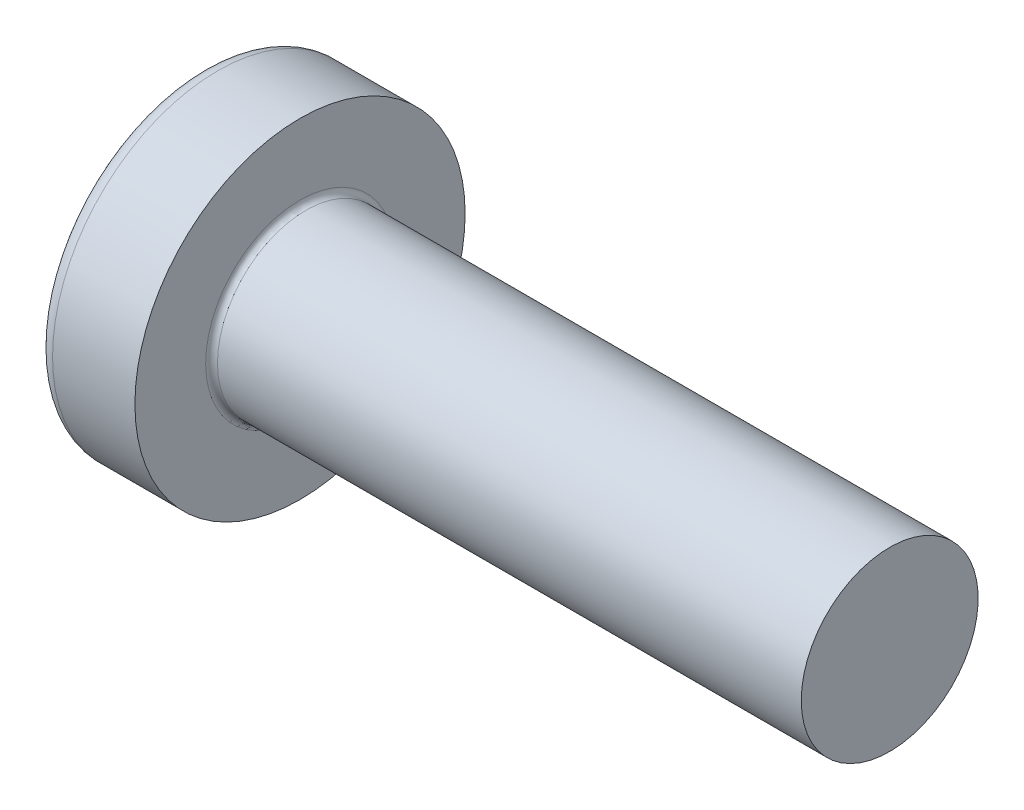
ISO-10303-21;
HEADER;
FILE_DESCRIPTION(('STEP AP214'),'2;1');
FILE_NAME('part.step','',(''),(''),'','','');
FILE_SCHEMA(('AUTOMOTIVE_DESIGN { 1 0 10303 214 1 1 1 1 }'));
ENDSEC;
DATA;
#1=APPLICATION_CONTEXT('core data for automotive mechanical design processes');
#2=APPLICATION_PROTOCOL_DEFINITION('international standard','automotive_design',2000,#1);
#3=PRODUCT_CONTEXT('',#1,'mechanical');
#4=PRODUCT('Part','Part','',(#3));
#5=PRODUCT_RELATED_PRODUCT_CATEGORY('part','',(#4));
#6=PRODUCT_DEFINITION_FORMATION('','',#4);
#7=PRODUCT_DEFINITION_CONTEXT('part definition',#1,'design');
#8=PRODUCT_DEFINITION('design','',#6,#7);
#9=PRODUCT_DEFINITION_SHAPE('','',#8);
#10=(LENGTH_UNIT() NAMED_UNIT(*) SI_UNIT(.MILLI.,.METRE.));
#11=(NAMED_UNIT(*) PLANE_ANGLE_UNIT() SI_UNIT($,.RADIAN.));
#12=(NAMED_UNIT(*) SI_UNIT($,.STERADIAN.) SOLID_ANGLE_UNIT());
#13=UNCERTAINTY_MEASURE_WITH_UNIT(LENGTH_MEASURE(1.E-05),#10,'distance_accuracy_value','');
#14=(GEOMETRIC_REPRESENTATION_CONTEXT(3) GLOBAL_UNCERTAINTY_ASSIGNED_CONTEXT((#13)) GLOBAL_UNIT_ASSIGNED_CONTEXT((#10,
#11,#12)) REPRESENTATION_CONTEXT('',''));
#15=CARTESIAN_POINT('',(0.,0.,0.));
#16=DIRECTION('',(0.,0.,1.));
#17=DIRECTION('',(1.,0.,0.));
#18=AXIS2_PLACEMENT_3D('',#15,#16,#17);
#19=CARTESIAN_POINT('',(5.,0.,0.));
#20=DIRECTION('',(-1.,0.,0.));
#21=DIRECTION('',(0.,1.,0.));
#22=AXIS2_PLACEMENT_3D('',#19,#20,#21);
#23=SPHERICAL_SURFACE('',#22,5.);
#24=CARTESIAN_POINT('',(0.775371598933733,0.,0.));
#25=DIRECTION('',(-1.,0.,0.));
#26=DIRECTION('',(0.,0.,1.));
#27=AXIS2_PLACEMENT_3D('',#24,#25,#26);
#28=CIRCLE('',#27,2.67441860465116);
#29=CARTESIAN_POINT('',(0.775371598933733,0.,2.67441860465116));
#30=VERTEX_POINT('',#29);
#31=EDGE_CURVE('E234',#30,#30,#28,.T.);
#32=ORIENTED_EDGE('',*,*,#31,.T.);
#33=EDGE_LOOP('',(#32));
#34=FACE_BOUND('',#33,.T.);
#35=CARTESIAN_POINT('',(0.0457951200896417,0.,0.));
#36=DIRECTION('',(1.,0.,0.));
#37=DIRECTION('',(0.,0.,-1.));
#38=AXIS2_PLACEMENT_3D('',#35,#36,#37);
#39=CIRCLE('',#38,0.675169614150692);
#40=CARTESIAN_POINT('',(0.0457951200896426,-0.369999999999998,-0.564760133040918));
#41=VERTEX_POINT('',#40);
#42=CARTESIAN_POINT('',(0.0457951200896417,-0.564760133040916,-0.37));
#43=VERTEX_POINT('',#42);
#44=EDGE_CURVE('E371',#41,#43,#39,.F.);
#45=ORIENTED_EDGE('',*,*,#44,.F.);
#46=CARTESIAN_POINT('',(5.,-0.37,0.));
#47=DIRECTION('',(0.,1.,0.));
#48=DIRECTION('',(0.,0.,1.));
#49=AXIS2_PLACEMENT_3D('',#46,#47,#48);
#50=CIRCLE('',#49,4.98629120689917);
#51=CARTESIAN_POINT('',(0.187869731256034,-0.369999999999995,-1.30633161051784));
#52=VERTEX_POINT('',#51);
#53=EDGE_CURVE('E297',#52,#41,#50,.T.);
#54=ORIENTED_EDGE('',*,*,#53,.F.);
#55=CARTESIAN_POINT('',(4.56358245832426,0.,0.875318202045668));
#56=DIRECTION('',(0.446197800778958,0.,-0.89493436774996));
#57=DIRECTION('',(-0.89493436774996,0.,-0.446197800778958));
#58=AXIS2_PLACEMENT_3D('',#55,#56,#57);
#59=CIRCLE('',#58,4.90340267309195);
#60=CARTESIAN_POINT('',(0.187869731256035,0.370000000000005,-1.30633161051784));
#61=VERTEX_POINT('',#60);
#62=EDGE_CURVE('E269',#52,#61,#59,.T.);
#63=ORIENTED_EDGE('',*,*,#62,.T.);
#64=CARTESIAN_POINT('',(5.,0.37,0.));
#65=DIRECTION('',(0.,-1.,0.));
#66=DIRECTION('',(0.,0.,-1.));
#67=AXIS2_PLACEMENT_3D('',#64,#65,#66);
#68=CIRCLE('',#67,4.98629120689917);
#69=CARTESIAN_POINT('',(0.0457951200896421,0.370000000000002,-0.564760133040916));
#70=VERTEX_POINT('',#69);
#71=EDGE_CURVE('E324',#70,#61,#68,.T.);
#72=ORIENTED_EDGE('',*,*,#71,.F.);
#73=CARTESIAN_POINT('',(0.0457951200896417,0.564760133040915,-0.37));
#74=VERTEX_POINT('',#73);
#75=EDGE_CURVE('E390',#74,#70,#39,.F.);
#76=ORIENTED_EDGE('',*,*,#75,.F.);
#77=CARTESIAN_POINT('',(5.,0.,-0.37));
#78=DIRECTION('',(0.,0.,1.));
#79=DIRECTION('',(1.,0.,0.));
#80=AXIS2_PLACEMENT_3D('',#77,#78,#79);
#81=CIRCLE('',#80,4.98629120689917);
#82=CARTESIAN_POINT('',(0.187869731256034,1.30633161051784,-0.37));
#83=VERTEX_POINT('',#82);
#84=EDGE_CURVE('E263',#83,#74,#81,.T.);
#85=ORIENTED_EDGE('',*,*,#84,.F.);
#86=CARTESIAN_POINT('',(4.56358245832426,-0.875318202045668,0.));
#87=DIRECTION('',(0.446197800778958,0.894934367749961,0.));
#88=DIRECTION('',(-0.89493436774996,0.446197800778958,0.));
#89=AXIS2_PLACEMENT_3D('',#86,#87,#88);
#90=CIRCLE('',#89,4.90340267309195);
#91=CARTESIAN_POINT('',(0.187869731256034,1.30633161051784,0.37));
#92=VERTEX_POINT('',#91);
#93=EDGE_CURVE('E266',#83,#92,#90,.T.);
#94=ORIENTED_EDGE('',*,*,#93,.T.);
#95=CARTESIAN_POINT('',(5.,0.,0.37));
#96=DIRECTION('',(0.,0.,-1.));
#97=DIRECTION('',(0.,1.,0.));
#98=AXIS2_PLACEMENT_3D('',#95,#96,#97);
#99=CIRCLE('',#98,4.98629120689917);
#100=CARTESIAN_POINT('',(0.0457951200896417,0.564760133040915,0.37));
#101=VERTEX_POINT('',#100);
#102=EDGE_CURVE('E259',#101,#92,#99,.T.);
#103=ORIENTED_EDGE('',*,*,#102,.F.);
#104=CARTESIAN_POINT('',(0.0457951200896426,0.369999999999998,0.564760133040918));
#105=VERTEX_POINT('',#104);
#106=EDGE_CURVE('E389',#105,#101,#39,.F.);
#107=ORIENTED_EDGE('',*,*,#106,.F.);
#108=CARTESIAN_POINT('',(0.187869731256033,0.369999999999995,1.30633161051784));
#109=VERTEX_POINT('',#108);
#110=EDGE_CURVE('E279',#109,#105,#68,.T.);
#111=ORIENTED_EDGE('',*,*,#110,.F.);
#112=CARTESIAN_POINT('',(4.56358245832426,0.,-0.875318202045669));
#113=DIRECTION('',(0.446197800778958,0.,0.894934367749961));
#114=DIRECTION('',(0.89493436774996,0.,-0.446197800778958));
#115=AXIS2_PLACEMENT_3D('',#112,#113,#114);
#116=CIRCLE('',#115,4.90340267309195);
#117=CARTESIAN_POINT('',(0.187869731256034,-0.370000000000005,1.30633161051784));
#118=VERTEX_POINT('',#117);
#119=EDGE_CURVE('E45',#109,#118,#116,.T.);
#120=ORIENTED_EDGE('',*,*,#119,.T.);
#121=CARTESIAN_POINT('',(0.0457951200896421,-0.370000000000002,0.564760133040916));
#122=VERTEX_POINT('',#121);
#123=EDGE_CURVE('E276',#122,#118,#50,.T.);
#124=ORIENTED_EDGE('',*,*,#123,.F.);
#125=CARTESIAN_POINT('',(0.0457951200896417,-0.564760133040916,0.37));
#126=VERTEX_POINT('',#125);
#127=EDGE_CURVE('E425',#126,#122,#39,.F.);
#128=ORIENTED_EDGE('',*,*,#127,.F.);
#129=CARTESIAN_POINT('',(0.187869731256033,-1.30633161051784,0.37));
#130=VERTEX_POINT('',#129);
#131=EDGE_CURVE('E260',#130,#126,#99,.T.);
#132=ORIENTED_EDGE('',*,*,#131,.F.);
#133=CARTESIAN_POINT('',(4.56358245832426,0.875318202045668,0.));
#134=DIRECTION('',(0.446197800778958,-0.89493436774996,0.));
#135=DIRECTION('',(0.89493436774996,0.446197800778958,0.));
#136=AXIS2_PLACEMENT_3D('',#133,#134,#135);
#137=CIRCLE('',#136,4.90340267309195);
#138=CARTESIAN_POINT('',(0.187869731256033,-1.30633161051784,-0.37));
#139=VERTEX_POINT('',#138);
#140=EDGE_CURVE('E256',#130,#139,#137,.T.);
#141=ORIENTED_EDGE('',*,*,#140,.T.);
#142=EDGE_CURVE('E60',#43,#139,#81,.T.);
#143=ORIENTED_EDGE('',*,*,#142,.F.);
#144=EDGE_LOOP('',(#45,#54,#63,#72,#76,#85,#94,#103,#107,#111,#120,#124,#128,#132,#141,#143));
#145=FACE_BOUND('',#144,.T.);
#146=ADVANCED_FACE('F32',(#34,#145),#23,.T.);
#147=CARTESIAN_POINT('',(1.75,0.527482216012805,-0.37));
#148=DIRECTION('',(0.,0.,1.));
#149=DIRECTION('',(1.,0.,0.));
#150=AXIS2_PLACEMENT_3D('',#147,#148,#149);
#151=PLANE('',#150);
#152=ORIENTED_EDGE('',*,*,#84,.T.);
#153=CARTESIAN_POINT('',(-0.987293237053716,0.649401255967161,-0.37));
#154=CARTESIAN_POINT('',(-0.781914975317084,0.632865887002871,-0.37));
#155=CARTESIAN_POINT('',(-0.576547882393372,0.616188977635081,-0.37));
#156=CARTESIAN_POINT('',(-0.165841599226327,0.582441031964227,-0.37));
#157=CARTESIAN_POINT('',(0.0394975903090452,0.56536998705488,-0.37));
#158=CARTESIAN_POINT('',(0.450133475422572,0.530723441326535,-0.37));
#159=CARTESIAN_POINT('',(0.655430171010573,0.513147940624557,-0.37));
#160=CARTESIAN_POINT('',(1.06596140177934,0.477314957985794,-0.37));
#161=CARTESIAN_POINT('',(1.2711959378071,0.459057485806066,-0.37));
#162=CARTESIAN_POINT('',(1.61065292365626,0.428051938688768,-0.37));
#163=CARTESIAN_POINT('',(1.74490059995643,0.415580824990931,-0.37));
#164=CARTESIAN_POINT('',(2.01334321762763,0.390092023404979,-0.37));
#165=CARTESIAN_POINT('',(2.14753815934577,0.377074339177353,-0.37));
#166=CARTESIAN_POINT('',(2.41586354151957,0.350315629452843,-0.37));
#167=CARTESIAN_POINT('',(2.5499939784531,0.33657456817765,-0.37));
#168=CARTESIAN_POINT('',(2.81814173295471,0.308004077741875,-0.37));
#169=CARTESIAN_POINT('',(2.95215904765134,0.293174621747065,-0.37));
#170=CARTESIAN_POINT('',(3.0860955068368,0.277618485071816,-0.37));
#171=B_SPLINE_CURVE_WITH_KNOTS('',3,(#153,#154,#155,#156,#157,#158,#159,#160,#161,#162,#163,
#164,#165,#166,#167,#168,#169,#170),.UNSPECIFIED.,.F.,.F.,(4,2,2,2,2,2,2,2,4),(0.,
0.618128793984691,1.23627109812525,1.85441325887562,2.4725465791681,2.87702276218609,
3.28149623678161,3.68598973550942,4.09049321032311),.UNSPECIFIED.);
#172=CARTESIAN_POINT('',(1.75,0.415013252800437,-0.370000000000001));
#173=VERTEX_POINT('',#172);
#174=EDGE_CURVE('E411',#74,#173,#171,.T.);
#175=ORIENTED_EDGE('',*,*,#174,.T.);
#176=DIRECTION('',(0.,1.,0.));
#177=VECTOR('',#176,1.);
#178=CARTESIAN_POINT('',(1.75,-0.527482216012805,-0.37));
#179=LINE('',#178,#177);
#180=CARTESIAN_POINT('',(1.75,0.527482216012805,-0.37));
#181=VERTEX_POINT('',#180);
#182=EDGE_CURVE('E353',#173,#181,#179,.T.);
#183=ORIENTED_EDGE('',*,*,#182,.T.);
#184=DIRECTION('',(0.89493436774996,-0.446197800778958,0.));
#185=VECTOR('',#184,1.);
#186=CARTESIAN_POINT('',(0.,1.4,-0.37));
#187=LINE('',#186,#185);
#188=EDGE_CURVE('E235',#83,#181,#187,.T.);
#189=ORIENTED_EDGE('',*,*,#188,.F.);
#190=EDGE_LOOP('',(#152,#175,#183,#189));
#191=FACE_BOUND('',#190,.T.);
#192=ADVANCED_FACE('F190',(#191),#151,.T.);
#193=CARTESIAN_POINT('',(1.75,-0.527482216012805,-0.37));
#194=VERTEX_POINT('',#193);
#195=CARTESIAN_POINT('',(1.75,-0.415013252800437,-0.370000000000001));
#196=VERTEX_POINT('',#195);
#197=EDGE_CURVE('E244',#194,#196,#179,.T.);
#198=ORIENTED_EDGE('',*,*,#197,.T.);
#199=CARTESIAN_POINT('',(-0.987293237053716,-0.649401255967161,-0.37));
#200=CARTESIAN_POINT('',(-0.781914975317084,-0.632865887002871,-0.37));
#201=CARTESIAN_POINT('',(-0.576547882393372,-0.616188977635081,-0.37));
#202=CARTESIAN_POINT('',(-0.165841599226327,-0.582441031964227,-0.37));
#203=CARTESIAN_POINT('',(0.0394975903090452,-0.56536998705488,-0.37));
#204=CARTESIAN_POINT('',(0.450133475422572,-0.530723441326535,-0.37));
#205=CARTESIAN_POINT('',(0.655430171010573,-0.513147940624557,-0.37));
#206=CARTESIAN_POINT('',(1.06596140177934,-0.477314957985794,-0.37));
#207=CARTESIAN_POINT('',(1.2711959378071,-0.459057485806066,-0.37));
#208=CARTESIAN_POINT('',(1.61065292365626,-0.428051938688768,-0.37));
#209=CARTESIAN_POINT('',(1.74490059995643,-0.415580824990931,-0.37));
#210=CARTESIAN_POINT('',(2.01334321762763,-0.390092023404979,-0.37));
#211=CARTESIAN_POINT('',(2.14753815934577,-0.377074339177353,-0.37));
#212=CARTESIAN_POINT('',(2.41586354151957,-0.350315629452843,-0.37));
#213=CARTESIAN_POINT('',(2.5499939784531,-0.33657456817765,-0.37));
#214=CARTESIAN_POINT('',(2.81814173295471,-0.308004077741875,-0.37));
#215=CARTESIAN_POINT('',(2.95215904765134,-0.293174621747065,-0.37));
#216=CARTESIAN_POINT('',(3.0860955068368,-0.277618485071816,-0.37));
#217=B_SPLINE_CURVE_WITH_KNOTS('',3,(#199,#200,#201,#202,#203,#204,#205,#206,#207,#208,#209,
#210,#211,#212,#213,#214,#215,#216),.UNSPECIFIED.,.F.,.F.,(4,2,2,2,2,2,2,2,4),(0.,
0.618128793984691,1.23627109812525,1.85441325887562,2.4725465791681,2.87702276218609,
3.28149623678161,3.68598973550942,4.09049321032311),.UNSPECIFIED.);
#218=EDGE_CURVE('E388',#196,#43,#217,.F.);
#219=ORIENTED_EDGE('',*,*,#218,.T.);
#220=ORIENTED_EDGE('',*,*,#142,.T.);
#221=DIRECTION('',(0.89493436774996,0.446197800778958,0.));
#222=VECTOR('',#221,1.);
#223=CARTESIAN_POINT('',(0.,-1.4,-0.37));
#224=LINE('',#223,#222);
#225=EDGE_CURVE('E327',#139,#194,#224,.T.);
#226=ORIENTED_EDGE('',*,*,#225,.T.);
#227=EDGE_LOOP('',(#198,#219,#220,#226));
#228=FACE_BOUND('',#227,.T.);
#229=ADVANCED_FACE('F196',(#228),#151,.T.);
#230=CARTESIAN_POINT('',(1.75,-0.527482216012805,0.37));
#231=DIRECTION('',(0.,0.,-1.));
#232=DIRECTION('',(0.,1.,0.));
#233=AXIS2_PLACEMENT_3D('',#230,#231,#232);
#234=PLANE('',#233);
#235=DIRECTION('',(0.,-1.,0.));
#236=VECTOR('',#235,1.);
#237=CARTESIAN_POINT('',(1.75,0.527482216012805,0.37));
#238=LINE('',#237,#236);
#239=CARTESIAN_POINT('',(1.75,0.527482216012805,0.37));
#240=VERTEX_POINT('',#239);
#241=CARTESIAN_POINT('',(1.75,0.415013252800437,0.370000000000001));
#242=VERTEX_POINT('',#241);
#243=EDGE_CURVE('E336',#240,#242,#238,.T.);
#244=ORIENTED_EDGE('',*,*,#243,.T.);
#245=CARTESIAN_POINT('',(-0.987293237053716,0.649401255967161,0.37));
#246=CARTESIAN_POINT('',(-0.781914975317084,0.632865887002871,0.37));
#247=CARTESIAN_POINT('',(-0.576547882393372,0.616188977635081,0.37));
#248=CARTESIAN_POINT('',(-0.165841599226327,0.582441031964227,0.37));
#249=CARTESIAN_POINT('',(0.0394975903090453,0.56536998705488,0.37));
#250=CARTESIAN_POINT('',(0.450133475422572,0.530723441326535,0.37));
#251=CARTESIAN_POINT('',(0.655430171010574,0.513147940624557,0.37));
#252=CARTESIAN_POINT('',(1.06596140177934,0.477314957985794,0.37));
#253=CARTESIAN_POINT('',(1.2711959378071,0.459057485806066,0.37));
#254=CARTESIAN_POINT('',(1.61065292365626,0.428051938688768,0.37));
#255=CARTESIAN_POINT('',(1.74490059995643,0.415580824990931,0.37));
#256=CARTESIAN_POINT('',(2.01334321762763,0.39009202340498,0.37));
#257=CARTESIAN_POINT('',(2.14753815934577,0.377074339177353,0.37));
#258=CARTESIAN_POINT('',(2.41586354151957,0.350315629452843,0.37));
#259=CARTESIAN_POINT('',(2.5499939784531,0.33657456817765,0.37));
#260=CARTESIAN_POINT('',(2.81814173295471,0.308004077741875,0.37));
#261=CARTESIAN_POINT('',(2.95215904765134,0.293174621747065,0.37));
#262=CARTESIAN_POINT('',(3.0860955068368,0.277618485071816,0.37));
#263=B_SPLINE_CURVE_WITH_KNOTS('',3,(#245,#246,#247,#248,#249,#250,#251,#252,#253,#254,#255,
#256,#257,#258,#259,#260,#261,#262),.UNSPECIFIED.,.F.,.F.,(4,2,2,2,2,2,2,2,4),(0.,
0.618128793984691,1.23627109812525,1.85441325887562,2.4725465791681,2.87702276218609,
3.28149623678161,3.68598973550942,4.09049321032311),.UNSPECIFIED.);
#264=EDGE_CURVE('E675',#242,#101,#263,.F.);
#265=ORIENTED_EDGE('',*,*,#264,.T.);
#266=ORIENTED_EDGE('',*,*,#102,.T.);
#267=DIRECTION('',(0.89493436774996,-0.446197800778958,0.));
#268=VECTOR('',#267,1.);
#269=CARTESIAN_POINT('',(0.,1.4,0.37));
#270=LINE('',#269,#268);
#271=EDGE_CURVE('E241',#92,#240,#270,.T.);
#272=ORIENTED_EDGE('',*,*,#271,.T.);
#273=EDGE_LOOP('',(#244,#265,#266,#272));
#274=FACE_BOUND('',#273,.T.);
#275=ADVANCED_FACE('F407',(#274),#234,.T.);
#276=ORIENTED_EDGE('',*,*,#131,.T.);
#277=CARTESIAN_POINT('',(-0.987293237069635,-0.649401255968442,0.37));
#278=CARTESIAN_POINT('',(-0.781914975331301,-0.632865887004023,0.37));
#279=CARTESIAN_POINT('',(-0.576547882405888,-0.616188977636102,0.37));
#280=CARTESIAN_POINT('',(-0.16584159923544,-0.582441031964983,0.37));
#281=CARTESIAN_POINT('',(0.0394975903016338,-0.5653699870555,0.37));
#282=CARTESIAN_POINT('',(0.450133475420601,-0.530723441326706,0.37));
#283=CARTESIAN_POINT('',(0.655430171012341,-0.513147940624409,0.37));
#284=CARTESIAN_POINT('',(1.06596140178858,-0.477314957984981,0.37));
#285=CARTESIAN_POINT('',(1.27119593782008,-0.459057485804908,0.37));
#286=CARTESIAN_POINT('',(1.61065292367297,-0.428051938687225,0.37));
#287=CARTESIAN_POINT('',(1.74490059997313,-0.415580824989368,0.37));
#288=CARTESIAN_POINT('',(2.01334321764434,-0.390092023403371,0.37));
#289=CARTESIAN_POINT('',(2.14753815936247,-0.377074339175718,0.37));
#290=CARTESIAN_POINT('',(2.41586354153627,-0.350315629451146,0.37));
#291=CARTESIAN_POINT('',(2.54999397846979,-0.336574568175918,0.37));
#292=CARTESIAN_POINT('',(2.8181417329714,-0.308004077740054,0.37));
#293=CARTESIAN_POINT('',(2.95215904766802,-0.29317462174519,0.37));
#294=CARTESIAN_POINT('',(3.08609550685347,-0.277618485069873,0.37));
#295=B_SPLINE_CURVE_WITH_KNOTS('',3,(#277,#278,#279,#280,#281,#282,#283,#284,#285,#286,#287,
#288,#289,#290,#291,#292,#293,#294),.UNSPECIFIED.,.F.,.F.,(4,2,2,2,2,2,2,2,4),(0.,
0.61812879398981,1.23627109813549,1.85441325889711,2.47254657920086,2.87702276221884,
3.28149623681437,3.68598973554218,4.09049321035586),.UNSPECIFIED.);
#296=CARTESIAN_POINT('',(1.75,-0.415013252800437,0.37));
#297=VERTEX_POINT('',#296);
#298=EDGE_CURVE('E426',#126,#297,#295,.T.);
#299=ORIENTED_EDGE('',*,*,#298,.T.);
#300=CARTESIAN_POINT('',(1.75,-0.527482216012805,0.37));
#301=VERTEX_POINT('',#300);
#302=EDGE_CURVE('E338',#297,#301,#238,.T.);
#303=ORIENTED_EDGE('',*,*,#302,.T.);
#304=DIRECTION('',(0.89493436774996,0.446197800778958,0.));
#305=VECTOR('',#304,1.);
#306=CARTESIAN_POINT('',(0.,-1.4,0.37));
#307=LINE('',#306,#305);
#308=EDGE_CURVE('E329',#130,#301,#307,.T.);
#309=ORIENTED_EDGE('',*,*,#308,.F.);
#310=EDGE_LOOP('',(#276,#299,#303,#309));
#311=FACE_BOUND('',#310,.T.);
#312=ADVANCED_FACE('F517',(#311),#234,.T.);
#313=CARTESIAN_POINT('',(1.75,0.527482216012805,0.37));
#314=DIRECTION('',(0.446197800778958,0.894934367749961,0.));
#315=DIRECTION('',(-0.89493436774996,0.446197800778958,0.));
#316=AXIS2_PLACEMENT_3D('',#313,#314,#315);
#317=PLANE('',#316);
#318=CARTESIAN_POINT('',(2.66965234556629,0.0689604865315897,0.));
#319=DIRECTION('',(0.446197800778958,0.894934367749961,0.));
#320=DIRECTION('',(-0.89493436774996,0.446197800778958,0.));
#321=AXIS2_PLACEMENT_3D('',#318,#319,#320);
#322=ELLIPSE('',#321,1.10195891266117,0.486831719863514);
#323=CARTESIAN_POINT('',(1.75,0.527482216012806,0.175779725196677));
#324=VERTEX_POINT('',#323);
#325=CARTESIAN_POINT('',(1.75,0.527482216012806,-0.175779725196677));
#326=VERTEX_POINT('',#325);
#327=EDGE_CURVE('E302',#324,#326,#322,.F.);
#328=ORIENTED_EDGE('',*,*,#327,.F.);
#329=DIRECTION('',(0.,0.,-1.));
#330=VECTOR('',#329,1.);
#331=CARTESIAN_POINT('',(1.75,0.527482216012805,0.37));
#332=LINE('',#331,#330);
#333=EDGE_CURVE('E339',#240,#324,#332,.T.);
#334=ORIENTED_EDGE('',*,*,#333,.F.);
#335=ORIENTED_EDGE('',*,*,#271,.F.);
#336=ORIENTED_EDGE('',*,*,#93,.F.);
#337=ORIENTED_EDGE('',*,*,#188,.T.);
#338=EDGE_CURVE('E341',#326,#181,#332,.T.);
#339=ORIENTED_EDGE('',*,*,#338,.F.);
#340=EDGE_LOOP('',(#328,#334,#335,#336,#337,#339));
#341=FACE_BOUND('',#340,.T.);
#342=ADVANCED_FACE('F405',(#341),#317,.F.);
#343=CARTESIAN_POINT('',(1.75,-0.527482216012805,-0.37));
#344=DIRECTION('',(0.446197800778958,-0.89493436774996,0.));
#345=DIRECTION('',(0.89493436774996,0.446197800778958,0.));
#346=AXIS2_PLACEMENT_3D('',#343,#344,#345);
#347=PLANE('',#346);
#348=CARTESIAN_POINT('',(2.66965234556629,-0.06896048653159,0.));
#349=DIRECTION('',(0.446197800778958,-0.89493436774996,0.));
#350=DIRECTION('',(-0.89493436774996,-0.446197800778958,0.));
#351=AXIS2_PLACEMENT_3D('',#348,#349,#350);
#352=ELLIPSE('',#351,1.10195891266117,0.486831719863513);
#353=CARTESIAN_POINT('',(1.75,-0.527482216012806,-0.175779725196678));
#354=VERTEX_POINT('',#353);
#355=CARTESIAN_POINT('',(1.75,-0.527482216012806,0.175779725196678));
#356=VERTEX_POINT('',#355);
#357=EDGE_CURVE('E677',#354,#356,#352,.F.);
#358=ORIENTED_EDGE('',*,*,#357,.F.);
#359=DIRECTION('',(0.,0.,1.));
#360=VECTOR('',#359,1.);
#361=CARTESIAN_POINT('',(1.75,-0.527482216012805,-0.37));
#362=LINE('',#361,#360);
#363=EDGE_CURVE('E332',#194,#354,#362,.T.);
#364=ORIENTED_EDGE('',*,*,#363,.F.);
#365=ORIENTED_EDGE('',*,*,#225,.F.);
#366=ORIENTED_EDGE('',*,*,#140,.F.);
#367=ORIENTED_EDGE('',*,*,#308,.T.);
#368=EDGE_CURVE('E335',#356,#301,#362,.T.);
#369=ORIENTED_EDGE('',*,*,#368,.F.);
#370=EDGE_LOOP('',(#358,#364,#365,#366,#367,#369));
#371=FACE_BOUND('',#370,.T.);
#372=ADVANCED_FACE('F504',(#371),#347,.F.);
#373=CARTESIAN_POINT('',(1.75,0.527482216012805,-0.37));
#374=DIRECTION('',(-1.,0.,0.));
#375=DIRECTION('',(0.,0.,1.));
#376=AXIS2_PLACEMENT_3D('',#373,#374,#375);
#377=PLANE('',#376);
#378=DIRECTION('',(0.,1.,0.));
#379=VECTOR('',#378,1.);
#380=CARTESIAN_POINT('',(1.75,-0.370000000000002,0.527482216012804));
#381=LINE('',#380,#379);
#382=CARTESIAN_POINT('',(1.75,-0.370000000000002,0.527482216012804));
#383=VERTEX_POINT('',#382);
#384=CARTESIAN_POINT('',(1.75,-0.175779725196681,0.527482216012805));
#385=VERTEX_POINT('',#384);
#386=EDGE_CURVE('E317',#383,#385,#381,.T.);
#387=ORIENTED_EDGE('',*,*,#386,.T.);
#388=CARTESIAN_POINT('',(1.75,0.,0.));
#389=DIRECTION('',(-1.,0.,0.));
#390=DIRECTION('',(0.,0.,1.));
#391=AXIS2_PLACEMENT_3D('',#388,#389,#390);
#392=CIRCLE('',#391,0.556);
#393=CARTESIAN_POINT('',(1.75,-0.370000000000001,0.415013252800436));
#394=VERTEX_POINT('',#393);
#395=EDGE_CURVE('E703',#394,#385,#392,.T.);
#396=ORIENTED_EDGE('',*,*,#395,.F.);
#397=DIRECTION('',(0.,0.,-1.));
#398=VECTOR('',#397,1.);
#399=CARTESIAN_POINT('',(1.75,-0.370000000000002,0.527482216012804));
#400=LINE('',#399,#398);
#401=EDGE_CURVE('E313',#383,#394,#400,.T.);
#402=ORIENTED_EDGE('',*,*,#401,.F.);
#403=EDGE_LOOP('',(#387,#396,#402));
#404=FACE_BOUND('',#403,.T.);
#405=ADVANCED_FACE('F461',(#404),#377,.T.);
#406=ORIENTED_EDGE('',*,*,#302,.F.);
#407=EDGE_CURVE('E708',#356,#297,#392,.T.);
#408=ORIENTED_EDGE('',*,*,#407,.F.);
#409=ORIENTED_EDGE('',*,*,#368,.T.);
#410=EDGE_LOOP('',(#406,#408,#409));
#411=FACE_BOUND('',#410,.T.);
#412=ADVANCED_FACE('F491',(#411),#377,.T.);
#413=ORIENTED_EDGE('',*,*,#363,.T.);
#414=EDGE_CURVE('E382',#196,#354,#392,.T.);
#415=ORIENTED_EDGE('',*,*,#414,.F.);
#416=ORIENTED_EDGE('',*,*,#197,.F.);
#417=EDGE_LOOP('',(#413,#415,#416));
#418=FACE_BOUND('',#417,.T.);
#419=ADVANCED_FACE('F485',(#418),#377,.T.);
#420=CARTESIAN_POINT('',(1.75,-0.369999999999998,-0.415013252800438));
#421=VERTEX_POINT('',#420);
#422=CARTESIAN_POINT('',(1.75,-0.369999999999998,-0.527482216012807));
#423=VERTEX_POINT('',#422);
#424=EDGE_CURVE('E316',#421,#423,#400,.T.);
#425=ORIENTED_EDGE('',*,*,#424,.F.);
#426=CARTESIAN_POINT('',(1.75,-0.175779725196678,-0.527482216012806));
#427=VERTEX_POINT('',#426);
#428=EDGE_CURVE('E52',#427,#421,#392,.T.);
#429=ORIENTED_EDGE('',*,*,#428,.F.);
#430=DIRECTION('',(0.,-1.,0.));
#431=VECTOR('',#430,1.);
#432=CARTESIAN_POINT('',(1.75,0.370000000000002,-0.527482216012804));
#433=LINE('',#432,#431);
#434=EDGE_CURVE('E312',#427,#423,#433,.T.);
#435=ORIENTED_EDGE('',*,*,#434,.T.);
#436=EDGE_LOOP('',(#425,#429,#435));
#437=FACE_BOUND('',#436,.T.);
#438=ADVANCED_FACE('F377',(#437),#377,.T.);
#439=CARTESIAN_POINT('',(1.75,0.370000000000002,-0.527482216012804));
#440=VERTEX_POINT('',#439);
#441=CARTESIAN_POINT('',(1.75,0.175779725196681,-0.527482216012805));
#442=VERTEX_POINT('',#441);
#443=EDGE_CURVE('E309',#440,#442,#433,.T.);
#444=ORIENTED_EDGE('',*,*,#443,.T.);
#445=CARTESIAN_POINT('',(1.75,0.370000000000001,-0.415013252800436));
#446=VERTEX_POINT('',#445);
#447=EDGE_CURVE('E381',#446,#442,#392,.T.);
#448=ORIENTED_EDGE('',*,*,#447,.F.);
#449=DIRECTION('',(0.,0.,1.));
#450=VECTOR('',#449,1.);
#451=CARTESIAN_POINT('',(1.75,0.370000000000002,-0.527482216012804));
#452=LINE('',#451,#450);
#453=EDGE_CURVE('E321',#440,#446,#452,.T.);
#454=ORIENTED_EDGE('',*,*,#453,.F.);
#455=EDGE_LOOP('',(#444,#448,#454));
#456=FACE_BOUND('',#455,.T.);
#457=ADVANCED_FACE('F473',(#456),#377,.T.);
#458=ORIENTED_EDGE('',*,*,#182,.F.);
#459=EDGE_CURVE('E692',#326,#173,#392,.T.);
#460=ORIENTED_EDGE('',*,*,#459,.F.);
#461=ORIENTED_EDGE('',*,*,#338,.T.);
#462=EDGE_LOOP('',(#458,#460,#461));
#463=FACE_BOUND('',#462,.T.);
#464=ADVANCED_FACE('F467',(#463),#377,.T.);
#465=ORIENTED_EDGE('',*,*,#333,.T.);
#466=EDGE_CURVE('E694',#242,#324,#392,.T.);
#467=ORIENTED_EDGE('',*,*,#466,.F.);
#468=ORIENTED_EDGE('',*,*,#243,.F.);
#469=EDGE_LOOP('',(#465,#467,#468));
#470=FACE_BOUND('',#469,.T.);
#471=ADVANCED_FACE('F459',(#470),#377,.T.);
#472=CARTESIAN_POINT('',(1.75,0.369999999999999,0.415013252800439));
#473=VERTEX_POINT('',#472);
#474=CARTESIAN_POINT('',(1.75,0.369999999999998,0.527482216012807));
#475=VERTEX_POINT('',#474);
#476=EDGE_CURVE('E294',#473,#475,#452,.T.);
#477=ORIENTED_EDGE('',*,*,#476,.F.);
#478=CARTESIAN_POINT('',(1.75,0.175779725196678,0.527482216012806));
#479=VERTEX_POINT('',#478);
#480=EDGE_CURVE('E383',#479,#473,#392,.T.);
#481=ORIENTED_EDGE('',*,*,#480,.F.);
#482=EDGE_CURVE('E320',#479,#475,#381,.T.);
#483=ORIENTED_EDGE('',*,*,#482,.T.);
#484=EDGE_LOOP('',(#477,#481,#483));
#485=FACE_BOUND('',#484,.T.);
#486=ADVANCED_FACE('F453',(#485),#377,.T.);
#487=CARTESIAN_POINT('',(1.75,0.369999999999998,0.527482216012806));
#488=DIRECTION('',(0.,-1.,0.));
#489=DIRECTION('',(1.,0.,0.));
#490=AXIS2_PLACEMENT_3D('',#487,#488,#489);
#491=PLANE('',#490);
#492=ORIENTED_EDGE('',*,*,#110,.T.);
#493=CARTESIAN_POINT('',(-0.987293237069635,0.369999999999998,0.649401255968443));
#494=CARTESIAN_POINT('',(-0.781914975331301,0.369999999999998,0.632865887004024));
#495=CARTESIAN_POINT('',(-0.576547882405888,0.369999999999998,0.616188977636103));
#496=CARTESIAN_POINT('',(-0.16584159923544,0.369999999999998,0.582441031964984));
#497=CARTESIAN_POINT('',(0.0394975903016338,0.369999999999998,0.565369987055501));
#498=CARTESIAN_POINT('',(0.450133475420601,0.369999999999998,0.530723441326707));
#499=CARTESIAN_POINT('',(0.655430171012341,0.369999999999998,0.51314794062441));
#500=CARTESIAN_POINT('',(1.06596140178858,0.369999999999998,0.477314957984982));
#501=CARTESIAN_POINT('',(1.27119593782008,0.369999999999998,0.459057485804909));
#502=CARTESIAN_POINT('',(1.61065292367297,0.369999999999999,0.428051938687226));
#503=CARTESIAN_POINT('',(1.74490059997313,0.369999999999999,0.415580824989369));
#504=CARTESIAN_POINT('',(2.01334321764434,0.369999999999999,0.390092023403372));
#505=CARTESIAN_POINT('',(2.14753815936247,0.369999999999999,0.37707433917572));
#506=CARTESIAN_POINT('',(2.41586354153627,0.369999999999999,0.350315629451147));
#507=CARTESIAN_POINT('',(2.54999397846979,0.369999999999999,0.336574568175919));
#508=CARTESIAN_POINT('',(2.8181417329714,0.369999999999999,0.308004077740055));
#509=CARTESIAN_POINT('',(2.95215904766802,0.369999999999999,0.293174621745191));
#510=CARTESIAN_POINT('',(3.08609550685347,0.369999999999999,0.277618485069875));
#511=B_SPLINE_CURVE_WITH_KNOTS('',3,(#493,#494,#495,#496,#497,#498,#499,#500,#501,#502,#503,
#504,#505,#506,#507,#508,#509,#510),.UNSPECIFIED.,.F.,.F.,(4,2,2,2,2,2,2,2,4),(0.,
0.61812879398981,1.23627109813549,1.85441325889711,2.47254657920086,2.87702276221884,
3.28149623681436,3.68598973554218,4.09049321035586),.UNSPECIFIED.);
#512=EDGE_CURVE('E674',#105,#473,#511,.T.);
#513=ORIENTED_EDGE('',*,*,#512,.T.);
#514=ORIENTED_EDGE('',*,*,#476,.T.);
#515=DIRECTION('',(0.89493436774996,0.,-0.446197800778958));
#516=VECTOR('',#515,1.);
#517=CARTESIAN_POINT('',(0.,0.369999999999995,1.4));
#518=LINE('',#517,#516);
#519=EDGE_CURVE('E287',#109,#475,#518,.T.);
#520=ORIENTED_EDGE('',*,*,#519,.F.);
#521=EDGE_LOOP('',(#492,#513,#514,#520));
#522=FACE_BOUND('',#521,.T.);
#523=ADVANCED_FACE('F291',(#522),#491,.T.);
#524=CARTESIAN_POINT('',(1.75,-0.369999999999998,-0.527482216012807));
#525=DIRECTION('',(0.,1.,0.));
#526=DIRECTION('',(0.,0.,1.));
#527=AXIS2_PLACEMENT_3D('',#524,#525,#526);
#528=PLANE('',#527);
#529=ORIENTED_EDGE('',*,*,#401,.T.);
#530=CARTESIAN_POINT('',(-0.987293237053716,-0.370000000000002,0.64940125596716));
#531=CARTESIAN_POINT('',(-0.781914975317084,-0.370000000000002,0.63286588700287));
#532=CARTESIAN_POINT('',(-0.576547882393372,-0.370000000000002,0.61618897763508));
#533=CARTESIAN_POINT('',(-0.165841599226327,-0.370000000000002,0.582441031964225));
#534=CARTESIAN_POINT('',(0.0394975903090451,-0.370000000000002,0.565369987054878));
#535=CARTESIAN_POINT('',(0.450133475422572,-0.370000000000002,0.530723441326533));
#536=CARTESIAN_POINT('',(0.655430171010573,-0.370000000000002,0.513147940624555));
#537=CARTESIAN_POINT('',(1.06596140177934,-0.370000000000002,0.477314957985793));
#538=CARTESIAN_POINT('',(1.2711959378071,-0.370000000000002,0.459057485806065));
#539=CARTESIAN_POINT('',(1.61065292365626,-0.370000000000001,0.428051938688767));
#540=CARTESIAN_POINT('',(1.74490059995642,-0.370000000000001,0.41558082499093));
#541=CARTESIAN_POINT('',(2.01334321762763,-0.370000000000001,0.390092023404978));
#542=CARTESIAN_POINT('',(2.14753815934577,-0.370000000000001,0.377074339177352));
#543=CARTESIAN_POINT('',(2.41586354151957,-0.370000000000001,0.350315629452841));
#544=CARTESIAN_POINT('',(2.5499939784531,-0.370000000000001,0.336574568177649));
#545=CARTESIAN_POINT('',(2.81814173295471,-0.370000000000001,0.308004077741874));
#546=CARTESIAN_POINT('',(2.95215904765134,-0.370000000000001,0.293174621747063));
#547=CARTESIAN_POINT('',(3.0860955068368,-0.370000000000001,0.277618485071814));
#548=B_SPLINE_CURVE_WITH_KNOTS('',3,(#530,#531,#532,#533,#534,#535,#536,#537,#538,#539,#540,
#541,#542,#543,#544,#545,#546,#547),.UNSPECIFIED.,.F.,.F.,(4,2,2,2,2,2,2,2,4),(0.,
0.618128793984691,1.23627109812525,1.85441325887562,2.4725465791681,2.87702276218609,
3.28149623678161,3.68598973550942,4.09049321032311),.UNSPECIFIED.);
#549=EDGE_CURVE('E419',#394,#122,#548,.F.);
#550=ORIENTED_EDGE('',*,*,#549,.T.);
#551=ORIENTED_EDGE('',*,*,#123,.T.);
#552=DIRECTION('',(0.89493436774996,0.,-0.446197800778958));
#553=VECTOR('',#552,1.);
#554=CARTESIAN_POINT('',(0.,-0.370000000000005,1.4));
#555=LINE('',#554,#553);
#556=EDGE_CURVE('E289',#118,#383,#555,.T.);
#557=ORIENTED_EDGE('',*,*,#556,.T.);
#558=EDGE_LOOP('',(#529,#550,#551,#557));
#559=FACE_BOUND('',#558,.T.);
#560=ADVANCED_FACE('F225',(#559),#528,.T.);
#561=CARTESIAN_POINT('',(1.75,-0.370000000000002,0.527482216012804));
#562=DIRECTION('',(0.446197800778958,0.,0.894934367749961));
#563=DIRECTION('',(-0.89493436774996,0.,0.446197800778958));
#564=AXIS2_PLACEMENT_3D('',#561,#562,#563);
#565=PLANE('',#564);
#566=CARTESIAN_POINT('',(2.66965234556629,0.,0.0689604865315897));
#567=DIRECTION('',(0.446197800778958,0.,0.894934367749961));
#568=DIRECTION('',(-0.89493436774996,0.,0.446197800778958));
#569=AXIS2_PLACEMENT_3D('',#566,#567,#568);
#570=ELLIPSE('',#569,1.10195891266117,0.486831719863514);
#571=EDGE_CURVE('E417',#385,#479,#570,.F.);
#572=ORIENTED_EDGE('',*,*,#571,.F.);
#573=ORIENTED_EDGE('',*,*,#386,.F.);
#574=ORIENTED_EDGE('',*,*,#556,.F.);
#575=ORIENTED_EDGE('',*,*,#119,.F.);
#576=ORIENTED_EDGE('',*,*,#519,.T.);
#577=ORIENTED_EDGE('',*,*,#482,.F.);
#578=EDGE_LOOP('',(#572,#573,#574,#575,#576,#577));
#579=FACE_BOUND('',#578,.T.);
#580=ADVANCED_FACE('F285',(#579),#565,.F.);
#581=CARTESIAN_POINT('',(1.75,0.370000000000002,-0.527482216012804));
#582=DIRECTION('',(0.446197800778958,0.,-0.89493436774996));
#583=DIRECTION('',(0.89493436774996,0.,0.446197800778958));
#584=AXIS2_PLACEMENT_3D('',#581,#582,#583);
#585=PLANE('',#584);
#586=CARTESIAN_POINT('',(2.66965234556629,0.,-0.0689604865315901));
#587=DIRECTION('',(0.446197800778958,0.,-0.89493436774996));
#588=DIRECTION('',(-0.89493436774996,0.,-0.446197800778958));
#589=AXIS2_PLACEMENT_3D('',#586,#587,#588);
#590=ELLIPSE('',#589,1.10195891266117,0.486831719863513);
#591=EDGE_CURVE('E375',#442,#427,#590,.F.);
#592=ORIENTED_EDGE('',*,*,#591,.F.);
#593=ORIENTED_EDGE('',*,*,#443,.F.);
#594=DIRECTION('',(0.89493436774996,0.,0.446197800778958));
#595=VECTOR('',#594,1.);
#596=CARTESIAN_POINT('',(0.,0.370000000000005,-1.4));
#597=LINE('',#596,#595);
#598=EDGE_CURVE('E299',#61,#440,#597,.T.);
#599=ORIENTED_EDGE('',*,*,#598,.F.);
#600=ORIENTED_EDGE('',*,*,#62,.F.);
#601=DIRECTION('',(0.89493436774996,0.,0.446197800778958));
#602=VECTOR('',#601,1.);
#603=CARTESIAN_POINT('',(0.,-0.369999999999995,-1.4));
#604=LINE('',#603,#602);
#605=EDGE_CURVE('E306',#52,#423,#604,.T.);
#606=ORIENTED_EDGE('',*,*,#605,.T.);
#607=ORIENTED_EDGE('',*,*,#434,.F.);
#608=EDGE_LOOP('',(#592,#593,#599,#600,#606,#607));
#609=FACE_BOUND('',#608,.T.);
#610=ADVANCED_FACE('F366',(#609),#585,.F.);
#611=ORIENTED_EDGE('',*,*,#453,.T.);
#612=CARTESIAN_POINT('',(-0.987293237053716,0.370000000000002,-0.649401255967159));
#613=CARTESIAN_POINT('',(-0.781914975317084,0.370000000000002,-0.63286588700287));
#614=CARTESIAN_POINT('',(-0.576547882393372,0.370000000000002,-0.61618897763508));
#615=CARTESIAN_POINT('',(-0.165841599226327,0.370000000000002,-0.582441031964225));
#616=CARTESIAN_POINT('',(0.039497590309045,0.370000000000002,-0.565369987054878));
#617=CARTESIAN_POINT('',(0.450133475422572,0.370000000000002,-0.530723441326533));
#618=CARTESIAN_POINT('',(0.655430171010573,0.370000000000002,-0.513147940624555));
#619=CARTESIAN_POINT('',(1.06596140177934,0.370000000000002,-0.477314957985793));
#620=CARTESIAN_POINT('',(1.2711959378071,0.370000000000002,-0.459057485806065));
#621=CARTESIAN_POINT('',(1.61065292365626,0.370000000000001,-0.428051938688767));
#622=CARTESIAN_POINT('',(1.74490059995642,0.370000000000001,-0.41558082499093));
#623=CARTESIAN_POINT('',(2.01334321762763,0.370000000000001,-0.390092023404978));
#624=CARTESIAN_POINT('',(2.14753815934577,0.370000000000001,-0.377074339177352));
#625=CARTESIAN_POINT('',(2.41586354151957,0.370000000000001,-0.350315629452841));
#626=CARTESIAN_POINT('',(2.5499939784531,0.370000000000001,-0.336574568177649));
#627=CARTESIAN_POINT('',(2.81814173295471,0.370000000000001,-0.308004077741874));
#628=CARTESIAN_POINT('',(2.95215904765134,0.370000000000001,-0.293174621747064));
#629=CARTESIAN_POINT('',(3.0860955068368,0.370000000000001,-0.277618485071814));
#630=B_SPLINE_CURVE_WITH_KNOTS('',3,(#612,#613,#614,#615,#616,#617,#618,#619,#620,#621,#622,
#623,#624,#625,#626,#627,#628,#629),.UNSPECIFIED.,.F.,.F.,(4,2,2,2,2,2,2,2,4),(0.,
0.618128793984691,1.23627109812525,1.85441325887562,2.4725465791681,2.87702276218609,
3.28149623678161,3.68598973550942,4.09049321032311),.UNSPECIFIED.);
#631=EDGE_CURVE('E362',#446,#70,#630,.F.);
#632=ORIENTED_EDGE('',*,*,#631,.T.);
#633=ORIENTED_EDGE('',*,*,#71,.T.);
#634=ORIENTED_EDGE('',*,*,#598,.T.);
#635=EDGE_LOOP('',(#611,#632,#633,#634));
#636=FACE_BOUND('',#635,.T.);
#637=ADVANCED_FACE('F223',(#636),#491,.T.);
#638=ORIENTED_EDGE('',*,*,#53,.T.);
#639=CARTESIAN_POINT('',(-0.987293237069635,-0.369999999999997,-0.649401255968443));
#640=CARTESIAN_POINT('',(-0.781914975331301,-0.369999999999997,-0.632865887004025));
#641=CARTESIAN_POINT('',(-0.576547882405888,-0.369999999999997,-0.616188977636104));
#642=CARTESIAN_POINT('',(-0.16584159923544,-0.369999999999998,-0.582441031964984));
#643=CARTESIAN_POINT('',(0.0394975903016337,-0.369999999999998,-0.565369987055501));
#644=CARTESIAN_POINT('',(0.450133475420601,-0.369999999999998,-0.530723441326707));
#645=CARTESIAN_POINT('',(0.655430171012341,-0.369999999999998,-0.51314794062441));
#646=CARTESIAN_POINT('',(1.06596140178858,-0.369999999999998,-0.477314957984982));
#647=CARTESIAN_POINT('',(1.27119593782008,-0.369999999999998,-0.459057485804909));
#648=CARTESIAN_POINT('',(1.61065292367297,-0.369999999999998,-0.428051938687226));
#649=CARTESIAN_POINT('',(1.74490059997313,-0.369999999999998,-0.415580824989369));
#650=CARTESIAN_POINT('',(2.01334321764434,-0.369999999999999,-0.390092023403372));
#651=CARTESIAN_POINT('',(2.14753815936247,-0.369999999999999,-0.37707433917572));
#652=CARTESIAN_POINT('',(2.41586354153627,-0.369999999999999,-0.350315629451147));
#653=CARTESIAN_POINT('',(2.54999397846979,-0.369999999999999,-0.336574568175919));
#654=CARTESIAN_POINT('',(2.8181417329714,-0.369999999999999,-0.308004077740055));
#655=CARTESIAN_POINT('',(2.95215904766802,-0.369999999999999,-0.293174621745191));
#656=CARTESIAN_POINT('',(3.08609550685347,-0.369999999999999,-0.277618485069875));
#657=B_SPLINE_CURVE_WITH_KNOTS('',3,(#639,#640,#641,#642,#643,#644,#645,#646,#647,#648,#649,
#650,#651,#652,#653,#654,#655,#656),.UNSPECIFIED.,.F.,.F.,(4,2,2,2,2,2,2,2,4),(0.,
0.61812879398981,1.23627109813549,1.85441325889711,2.47254657920086,2.87702276221884,
3.28149623681436,3.68598973554218,4.09049321035586),.UNSPECIFIED.);
#658=EDGE_CURVE('E11',#41,#421,#657,.T.);
#659=ORIENTED_EDGE('',*,*,#658,.T.);
#660=ORIENTED_EDGE('',*,*,#424,.T.);
#661=ORIENTED_EDGE('',*,*,#605,.F.);
#662=EDGE_LOOP('',(#638,#659,#660,#661));
#663=FACE_BOUND('',#662,.T.);
#664=ADVANCED_FACE('F218',(#663),#528,.T.);
#665=CARTESIAN_POINT('',(-25.4,0.,0.));
#666=DIRECTION('',(-1.,0.,0.));
#667=DIRECTION('',(0.,0.,1.));
#668=AXIS2_PLACEMENT_3D('',#665,#666,#667);
#669=CYLINDRICAL_SURFACE('',#668,1.5);
#670=CARTESIAN_POINT('',(2.5,0.,0.));
#671=DIRECTION('',(-1.,0.,0.));
#672=DIRECTION('',(0.,0.,1.));
#673=AXIS2_PLACEMENT_3D('',#670,#671,#672);
#674=CIRCLE('',#673,1.5);
#675=CARTESIAN_POINT('',(2.5,0.,1.5));
#676=VERTEX_POINT('',#675);
#677=EDGE_CURVE('E229',#676,#676,#674,.F.);
#678=ORIENTED_EDGE('',*,*,#677,.T.);
#679=EDGE_LOOP('',(#678));
#680=FACE_BOUND('',#679,.T.);
#681=CARTESIAN_POINT('',(12.4,0.,0.));
#682=DIRECTION('',(-1.,0.,0.));
#683=DIRECTION('',(0.,0.,1.));
#684=AXIS2_PLACEMENT_3D('',#681,#682,#683);
#685=CIRCLE('',#684,1.5);
#686=CARTESIAN_POINT('',(12.4,0.,1.5));
#687=VERTEX_POINT('',#686);
#688=EDGE_CURVE('E232',#687,#687,#685,.T.);
#689=ORIENTED_EDGE('',*,*,#688,.T.);
#690=EDGE_LOOP('',(#689));
#691=FACE_BOUND('',#690,.T.);
#692=ADVANCED_FACE('F215',(#680,#691),#669,.T.);
#693=CARTESIAN_POINT('',(2.4,1.5,0.));
#694=DIRECTION('',(-1.,0.,0.));
#695=DIRECTION('',(0.,0.,1.));
#696=AXIS2_PLACEMENT_3D('',#693,#694,#695);
#697=PLANE('',#696);
#698=CARTESIAN_POINT('',(2.4,0.,0.));
#699=DIRECTION('',(-1.,0.,0.));
#700=DIRECTION('',(0.,0.,1.));
#701=AXIS2_PLACEMENT_3D('',#698,#699,#700);
#702=CIRCLE('',#701,1.6);
#703=CARTESIAN_POINT('',(2.4,0.,1.6));
#704=VERTEX_POINT('',#703);
#705=EDGE_CURVE('E252',#704,#704,#702,.T.);
#706=ORIENTED_EDGE('',*,*,#705,.T.);
#707=EDGE_LOOP('',(#706));
#708=FACE_BOUND('',#707,.T.);
#709=CARTESIAN_POINT('',(2.4,0.,0.));
#710=DIRECTION('',(-1.,0.,0.));
#711=DIRECTION('',(0.,0.,1.));
#712=AXIS2_PLACEMENT_3D('',#709,#710,#711);
#713=CIRCLE('',#712,2.8);
#714=CARTESIAN_POINT('',(2.4,0.,2.8));
#715=VERTEX_POINT('',#714);
#716=EDGE_CURVE('E249',#715,#715,#713,.T.);
#717=ORIENTED_EDGE('',*,*,#716,.F.);
#718=EDGE_LOOP('',(#717));
#719=FACE_BOUND('',#718,.T.);
#720=ADVANCED_FACE('F212',(#708,#719),#697,.F.);
#721=CARTESIAN_POINT('',(-25.4,0.,0.));
#722=DIRECTION('',(-1.,0.,0.));
#723=DIRECTION('',(0.,0.,1.));
#724=AXIS2_PLACEMENT_3D('',#721,#722,#723);
#725=CYLINDRICAL_SURFACE('',#724,2.8);
#726=ORIENTED_EDGE('',*,*,#716,.T.);
#727=EDGE_LOOP('',(#726));
#728=FACE_BOUND('',#727,.T.);
#729=CARTESIAN_POINT('',(1.00350153259131,0.,0.));
#730=DIRECTION('',(-1.,0.,0.));
#731=DIRECTION('',(0.,0.,1.));
#732=AXIS2_PLACEMENT_3D('',#729,#730,#731);
#733=CIRCLE('',#732,2.8);
#734=CARTESIAN_POINT('',(1.00350153259131,0.,2.8));
#735=VERTEX_POINT('',#734);
#736=EDGE_CURVE('E238',#735,#735,#733,.T.);
#737=ORIENTED_EDGE('',*,*,#736,.F.);
#738=EDGE_LOOP('',(#737));
#739=FACE_BOUND('',#738,.T.);
#740=ADVANCED_FACE('F208',(#728,#739),#725,.T.);
#741=CARTESIAN_POINT('',(1.00350153259131,0.,0.));
#742=DIRECTION('',(-1.,0.,0.));
#743=DIRECTION('',(0.,0.,1.));
#744=AXIS2_PLACEMENT_3D('',#741,#742,#743);
#745=TOROIDAL_SURFACE('',#744,2.53,0.270000000000001);
#746=ORIENTED_EDGE('',*,*,#736,.T.);
#747=EDGE_LOOP('',(#746));
#748=FACE_BOUND('',#747,.T.);
#749=ORIENTED_EDGE('',*,*,#31,.F.);
#750=EDGE_LOOP('',(#749));
#751=FACE_BOUND('',#750,.T.);
#752=ADVANCED_FACE('F205',(#748,#751),#745,.T.);
#753=CARTESIAN_POINT('',(12.4,1.5,0.));
#754=DIRECTION('',(1.,0.,0.));
#755=DIRECTION('',(0.,0.,-1.));
#756=AXIS2_PLACEMENT_3D('',#753,#754,#755);
#757=PLANE('',#756);
#758=ORIENTED_EDGE('',*,*,#688,.F.);
#759=EDGE_LOOP('',(#758));
#760=FACE_BOUND('',#759,.T.);
#761=ADVANCED_FACE('F203',(#760),#757,.T.);
#762=CARTESIAN_POINT('',(2.5,0.,0.));
#763=DIRECTION('',(-1.,0.,0.));
#764=DIRECTION('',(0.,0.,1.));
#765=AXIS2_PLACEMENT_3D('',#762,#763,#764);
#766=TOROIDAL_SURFACE('',#765,1.6,0.1);
#767=ORIENTED_EDGE('',*,*,#677,.F.);
#768=EDGE_LOOP('',(#767));
#769=FACE_BOUND('',#768,.T.);
#770=ORIENTED_EDGE('',*,*,#705,.F.);
#771=EDGE_LOOP('',(#770));
#772=FACE_BOUND('',#771,.T.);
#773=ADVANCED_FACE('F34',(#769,#772),#766,.F.);
#774=CARTESIAN_POINT('',(1.75,0.,0.));
#775=DIRECTION('',(-1.,0.,0.));
#776=DIRECTION('',(0.,0.,1.));
#777=AXIS2_PLACEMENT_3D('',#774,#775,#776);
#778=CONICAL_SURFACE('',#777,0.556,0.0698131700797659);
#779=ORIENTED_EDGE('',*,*,#327,.T.);
#780=EDGE_CURVE('E689',#324,#326,#392,.T.);
#781=ORIENTED_EDGE('',*,*,#780,.F.);
#782=EDGE_LOOP('',(#779,#781));
#783=FACE_BOUND('',#782,.T.);
#784=ADVANCED_FACE('F187',(#783),#778,.F.);
#785=ORIENTED_EDGE('',*,*,#357,.T.);
#786=EDGE_CURVE('E709',#354,#356,#392,.T.);
#787=ORIENTED_EDGE('',*,*,#786,.F.);
#788=EDGE_LOOP('',(#785,#787));
#789=FACE_BOUND('',#788,.T.);
#790=ADVANCED_FACE('F604',(#789),#778,.F.);
#791=EDGE_CURVE('E385',#473,#242,#392,.T.);
#792=ORIENTED_EDGE('',*,*,#791,.F.);
#793=ORIENTED_EDGE('',*,*,#512,.F.);
#794=ORIENTED_EDGE('',*,*,#106,.T.);
#795=ORIENTED_EDGE('',*,*,#264,.F.);
#796=EDGE_LOOP('',(#792,#793,#794,#795));
#797=FACE_BOUND('',#796,.T.);
#798=ADVANCED_FACE('F611',(#797),#778,.F.);
#799=ORIENTED_EDGE('',*,*,#571,.T.);
#800=EDGE_CURVE('E386',#385,#479,#392,.T.);
#801=ORIENTED_EDGE('',*,*,#800,.F.);
#802=EDGE_LOOP('',(#799,#801));
#803=FACE_BOUND('',#802,.T.);
#804=ADVANCED_FACE('F618',(#803),#778,.F.);
#805=ORIENTED_EDGE('',*,*,#591,.T.);
#806=EDGE_CURVE('E378',#442,#427,#392,.T.);
#807=ORIENTED_EDGE('',*,*,#806,.F.);
#808=EDGE_LOOP('',(#805,#807));
#809=FACE_BOUND('',#808,.T.);
#810=ADVANCED_FACE('F625',(#809),#778,.F.);
#811=ORIENTED_EDGE('',*,*,#127,.T.);
#812=ORIENTED_EDGE('',*,*,#549,.F.);
#813=EDGE_CURVE('E705',#297,#394,#392,.T.);
#814=ORIENTED_EDGE('',*,*,#813,.F.);
#815=ORIENTED_EDGE('',*,*,#298,.F.);
#816=EDGE_LOOP('',(#811,#812,#814,#815));
#817=FACE_BOUND('',#816,.T.);
#818=ADVANCED_FACE('F632',(#817),#778,.F.);
#819=ORIENTED_EDGE('',*,*,#75,.T.);
#820=ORIENTED_EDGE('',*,*,#631,.F.);
#821=EDGE_CURVE('E695',#173,#446,#392,.T.);
#822=ORIENTED_EDGE('',*,*,#821,.F.);
#823=ORIENTED_EDGE('',*,*,#174,.F.);
#824=EDGE_LOOP('',(#819,#820,#822,#823));
#825=FACE_BOUND('',#824,.T.);
#826=ADVANCED_FACE('F185',(#825),#778,.F.);
#827=EDGE_CURVE('E379',#421,#196,#392,.T.);
#828=ORIENTED_EDGE('',*,*,#827,.F.);
#829=ORIENTED_EDGE('',*,*,#658,.F.);
#830=ORIENTED_EDGE('',*,*,#44,.T.);
#831=ORIENTED_EDGE('',*,*,#218,.F.);
#832=EDGE_LOOP('',(#828,#829,#830,#831));
#833=FACE_BOUND('',#832,.T.);
#834=ADVANCED_FACE('F180',(#833),#778,.F.);
#835=CARTESIAN_POINT('',(1.93065535110549,0.,0.));
#836=DIRECTION('',(-1.,0.,0.));
#837=DIRECTION('',(0.,0.,1.));
#838=AXIS2_PLACEMENT_3D('',#835,#836,#837);
#839=CONICAL_SURFACE('',#838,0.,1.25663706143592);
#840=ORIENTED_EDGE('',*,*,#480,.T.);
#841=ORIENTED_EDGE('',*,*,#791,.T.);
#842=ORIENTED_EDGE('',*,*,#466,.T.);
#843=ORIENTED_EDGE('',*,*,#780,.T.);
#844=ORIENTED_EDGE('',*,*,#459,.T.);
#845=ORIENTED_EDGE('',*,*,#821,.T.);
#846=ORIENTED_EDGE('',*,*,#447,.T.);
#847=ORIENTED_EDGE('',*,*,#806,.T.);
#848=ORIENTED_EDGE('',*,*,#428,.T.);
#849=ORIENTED_EDGE('',*,*,#827,.T.);
#850=ORIENTED_EDGE('',*,*,#414,.T.);
#851=ORIENTED_EDGE('',*,*,#786,.T.);
#852=ORIENTED_EDGE('',*,*,#407,.T.);
#853=ORIENTED_EDGE('',*,*,#813,.T.);
#854=ORIENTED_EDGE('',*,*,#395,.T.);
#855=ORIENTED_EDGE('',*,*,#800,.T.);
#856=EDGE_LOOP('',(#840,#841,#842,#843,#844,#845,#846,#847,#848,#849,#850,#851,#852,#853,#854,#855));
#857=FACE_BOUND('',#856,.T.);
#858=CARTESIAN_POINT('',(1.93065535110549,0.,0.));
#859=VERTEX_POINT('',#858);
#860=VERTEX_LOOP('',#859);
#861=FACE_BOUND('',#860,.T.);
#862=ADVANCED_FACE('F178',(#857,#861),#839,.F.);
#863=CLOSED_SHELL('',(#146,#192,#229,#275,#312,#342,#372,#405,#412,#419,#438,#457,#464,#471,
#486,#523,#560,#580,#610,#637,#664,#692,#720,#740,#752,#761,#773,#784,#790,#798,#804,#810,#818,
#826,#834,#862));
#864=MANIFOLD_SOLID_BREP('B2',#863);
#865=ADVANCED_BREP_SHAPE_REPRESENTATION('',(#18,#864),#14);
#866=SHAPE_DEFINITION_REPRESENTATION(#9,#865);
ENDSEC;
END-ISO-10303-21;
